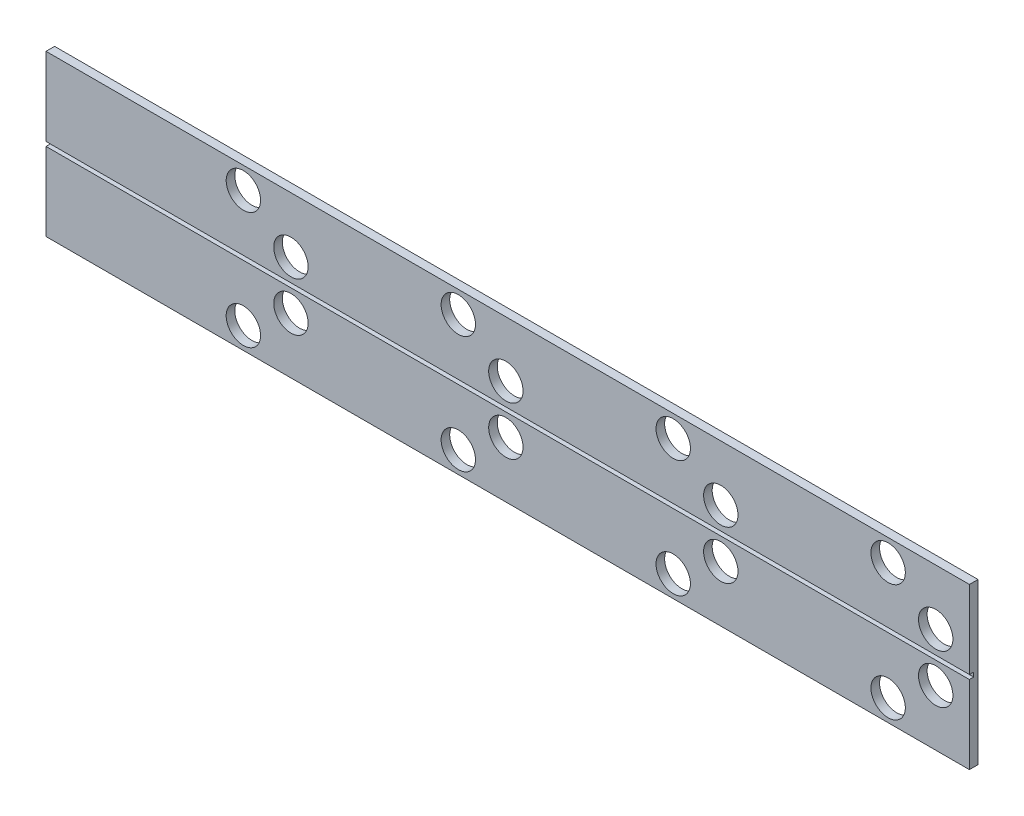
ISO-10303-21;
HEADER;
FILE_DESCRIPTION(('STEP AP214'),'2;1');
FILE_NAME('part.step','',(''),(''),'','','');
FILE_SCHEMA(('AUTOMOTIVE_DESIGN { 1 0 10303 214 1 1 1 1 }'));
ENDSEC;
DATA;
#1=APPLICATION_CONTEXT('core data for automotive mechanical design processes');
#2=APPLICATION_PROTOCOL_DEFINITION('international standard','automotive_design',2000,#1);
#3=PRODUCT_CONTEXT('',#1,'mechanical');
#4=PRODUCT('Part','Part','',(#3));
#5=PRODUCT_RELATED_PRODUCT_CATEGORY('part','',(#4));
#6=PRODUCT_DEFINITION_FORMATION('','',#4);
#7=PRODUCT_DEFINITION_CONTEXT('part definition',#1,'design');
#8=PRODUCT_DEFINITION('design','',#6,#7);
#9=PRODUCT_DEFINITION_SHAPE('','',#8);
#10=(LENGTH_UNIT() NAMED_UNIT(*) SI_UNIT(.MILLI.,.METRE.));
#11=(NAMED_UNIT(*) PLANE_ANGLE_UNIT() SI_UNIT($,.RADIAN.));
#12=(NAMED_UNIT(*) SI_UNIT($,.STERADIAN.) SOLID_ANGLE_UNIT());
#13=UNCERTAINTY_MEASURE_WITH_UNIT(LENGTH_MEASURE(1.E-05),#10,'distance_accuracy_value','');
#14=(GEOMETRIC_REPRESENTATION_CONTEXT(3) GLOBAL_UNCERTAINTY_ASSIGNED_CONTEXT((#13)) GLOBAL_UNIT_ASSIGNED_CONTEXT((#10,
#11,#12)) REPRESENTATION_CONTEXT('',''));
#15=CARTESIAN_POINT('',(0.,0.,0.));
#16=DIRECTION('',(0.,0.,1.));
#17=DIRECTION('',(1.,0.,0.));
#18=AXIS2_PLACEMENT_3D('',#15,#16,#17);
#19=CARTESIAN_POINT('',(0.,0.,0.2));
#20=DIRECTION('',(0.,0.,1.));
#21=DIRECTION('',(1.,0.,0.));
#22=AXIS2_PLACEMENT_3D('',#19,#20,#21);
#23=PLANE('',#22);
#24=CARTESIAN_POINT('',(-6.14935824448216,1.35966981169838,0.2));
#25=DIRECTION('',(0.,0.,1.));
#26=DIRECTION('',(1.,0.,0.));
#27=AXIS2_PLACEMENT_3D('',#24,#25,#26);
#28=CIRCLE('',#27,0.400000000000001);
#29=CARTESIAN_POINT('',(-5.74935824448216,1.35966981169838,0.2));
#30=VERTEX_POINT('',#29);
#31=EDGE_CURVE('E484',#30,#30,#28,.T.);
#32=ORIENTED_EDGE('',*,*,#31,.F.);
#33=EDGE_LOOP('',(#32));
#34=FACE_BOUND('',#33,.T.);
#35=CARTESIAN_POINT('',(-5.04281811205357,0.571259967343007,0.2));
#36=DIRECTION('',(0.,0.,1.));
#37=DIRECTION('',(1.,0.,0.));
#38=AXIS2_PLACEMENT_3D('',#35,#36,#37);
#39=CIRCLE('',#38,0.4);
#40=CARTESIAN_POINT('',(-4.64281811205357,0.571259967343007,0.2));
#41=VERTEX_POINT('',#40);
#42=EDGE_CURVE('E486',#41,#41,#39,.T.);
#43=ORIENTED_EDGE('',*,*,#42,.F.);
#44=EDGE_LOOP('',(#43));
#45=FACE_BOUND('',#44,.T.);
#46=CARTESIAN_POINT('',(-1.14935824448216,1.35966981169838,0.2));
#47=DIRECTION('',(0.,0.,1.));
#48=DIRECTION('',(1.,0.,0.));
#49=AXIS2_PLACEMENT_3D('',#46,#47,#48);
#50=CIRCLE('',#49,0.400000000000001);
#51=CARTESIAN_POINT('',(-0.749358244482159,1.35966981169838,0.2));
#52=VERTEX_POINT('',#51);
#53=EDGE_CURVE('E498',#52,#52,#50,.T.);
#54=ORIENTED_EDGE('',*,*,#53,.F.);
#55=EDGE_LOOP('',(#54));
#56=FACE_BOUND('',#55,.T.);
#57=CARTESIAN_POINT('',(-0.0428181120535696,0.571259967343007,0.2));
#58=DIRECTION('',(0.,0.,1.));
#59=DIRECTION('',(1.,0.,0.));
#60=AXIS2_PLACEMENT_3D('',#57,#58,#59);
#61=CIRCLE('',#60,0.4);
#62=CARTESIAN_POINT('',(0.35718188794643,0.571259967343007,0.2));
#63=VERTEX_POINT('',#62);
#64=EDGE_CURVE('E502',#63,#63,#61,.T.);
#65=ORIENTED_EDGE('',*,*,#64,.F.);
#66=EDGE_LOOP('',(#65));
#67=FACE_BOUND('',#66,.T.);
#68=CARTESIAN_POINT('',(3.85064175551784,1.35966981169838,0.2));
#69=DIRECTION('',(0.,0.,1.));
#70=DIRECTION('',(1.,0.,0.));
#71=AXIS2_PLACEMENT_3D('',#68,#69,#70);
#72=CIRCLE('',#71,0.400000000000001);
#73=CARTESIAN_POINT('',(4.25064175551784,1.35966981169838,0.2));
#74=VERTEX_POINT('',#73);
#75=EDGE_CURVE('E514',#74,#74,#72,.T.);
#76=ORIENTED_EDGE('',*,*,#75,.F.);
#77=EDGE_LOOP('',(#76));
#78=FACE_BOUND('',#77,.T.);
#79=CARTESIAN_POINT('',(4.95718188794643,0.571259967343007,0.2));
#80=DIRECTION('',(0.,0.,1.));
#81=DIRECTION('',(1.,0.,0.));
#82=AXIS2_PLACEMENT_3D('',#79,#80,#81);
#83=CIRCLE('',#82,0.4);
#84=CARTESIAN_POINT('',(5.35718188794643,0.571259967343007,0.2));
#85=VERTEX_POINT('',#84);
#86=EDGE_CURVE('E518',#85,#85,#83,.T.);
#87=ORIENTED_EDGE('',*,*,#86,.F.);
#88=EDGE_LOOP('',(#87));
#89=FACE_BOUND('',#88,.T.);
#90=CARTESIAN_POINT('',(8.85064175551784,1.35966981169838,0.2));
#91=DIRECTION('',(0.,0.,1.));
#92=DIRECTION('',(1.,0.,0.));
#93=AXIS2_PLACEMENT_3D('',#90,#91,#92);
#94=CIRCLE('',#93,0.400000000000001);
#95=CARTESIAN_POINT('',(9.25064175551784,1.35966981169838,0.2));
#96=VERTEX_POINT('',#95);
#97=EDGE_CURVE('E530',#96,#96,#94,.T.);
#98=ORIENTED_EDGE('',*,*,#97,.F.);
#99=EDGE_LOOP('',(#98));
#100=FACE_BOUND('',#99,.T.);
#101=CARTESIAN_POINT('',(9.95718188794643,0.571259967343007,0.2));
#102=DIRECTION('',(0.,0.,1.));
#103=DIRECTION('',(1.,0.,0.));
#104=AXIS2_PLACEMENT_3D('',#101,#102,#103);
#105=CIRCLE('',#104,0.4);
#106=CARTESIAN_POINT('',(10.3571818879464,0.571259967343007,0.2));
#107=VERTEX_POINT('',#106);
#108=EDGE_CURVE('E534',#107,#107,#105,.T.);
#109=ORIENTED_EDGE('',*,*,#108,.F.);
#110=EDGE_LOOP('',(#109));
#111=FACE_BOUND('',#110,.T.);
#112=DIRECTION('',(-1.,0.,0.));
#113=VECTOR('',#112,1.);
#114=CARTESIAN_POINT('',(10.7410625976883,0.05,0.2));
#115=LINE('',#114,#113);
#116=CARTESIAN_POINT('',(10.7410625976883,0.05,0.2));
#117=VERTEX_POINT('',#116);
#118=CARTESIAN_POINT('',(-10.7410625976883,0.05,0.2));
#119=VERTEX_POINT('',#118);
#120=EDGE_CURVE('E123',#117,#119,#115,.T.);
#121=ORIENTED_EDGE('',*,*,#120,.F.);
#122=DIRECTION('',(0.,1.,0.));
#123=VECTOR('',#122,1.);
#124=CARTESIAN_POINT('',(10.7410625976883,1.86597544762487,0.2));
#125=LINE('',#124,#123);
#126=CARTESIAN_POINT('',(10.7410625976883,1.86597544762487,0.2));
#127=VERTEX_POINT('',#126);
#128=EDGE_CURVE('E85',#117,#127,#125,.T.);
#129=ORIENTED_EDGE('',*,*,#128,.T.);
#130=DIRECTION('',(-1.,0.,0.));
#131=VECTOR('',#130,1.);
#132=CARTESIAN_POINT('',(-10.7410625976883,1.86597544762487,0.2));
#133=LINE('',#132,#131);
#134=CARTESIAN_POINT('',(-10.7410625976883,1.86597544762487,0.2));
#135=VERTEX_POINT('',#134);
#136=EDGE_CURVE('E137',#127,#135,#133,.T.);
#137=ORIENTED_EDGE('',*,*,#136,.T.);
#138=DIRECTION('',(0.,-1.,0.));
#139=VECTOR('',#138,1.);
#140=CARTESIAN_POINT('',(-10.7410625976883,1.86597544762487,0.2));
#141=LINE('',#140,#139);
#142=EDGE_CURVE('E139',#135,#119,#141,.T.);
#143=ORIENTED_EDGE('',*,*,#142,.T.);
#144=EDGE_LOOP('',(#121,#129,#137,#143));
#145=FACE_BOUND('',#144,.T.);
#146=ADVANCED_FACE('F32',(#34,#45,#56,#67,#78,#89,#100,#111,#145),#23,.T.);
#147=CARTESIAN_POINT('',(10.7410625976883,1.86597544762487,0.2));
#148=DIRECTION('',(-1.,0.,0.));
#149=DIRECTION('',(0.,0.,1.));
#150=AXIS2_PLACEMENT_3D('',#147,#148,#149);
#151=PLANE('',#150);
#152=ORIENTED_EDGE('',*,*,#128,.F.);
#153=DIRECTION('',(0.,0.,1.));
#154=VECTOR('',#153,1.);
#155=CARTESIAN_POINT('',(10.7410625976883,0.05,0.1));
#156=LINE('',#155,#154);
#157=CARTESIAN_POINT('',(10.7410625976883,0.05,0.1));
#158=VERTEX_POINT('',#157);
#159=EDGE_CURVE('E130',#158,#117,#156,.T.);
#160=ORIENTED_EDGE('',*,*,#159,.F.);
#161=DIRECTION('',(0.,1.,0.));
#162=VECTOR('',#161,1.);
#163=CARTESIAN_POINT('',(10.7410625976883,-0.05,0.1));
#164=LINE('',#163,#162);
#165=CARTESIAN_POINT('',(10.7410625976883,-0.05,0.1));
#166=VERTEX_POINT('',#165);
#167=EDGE_CURVE('E113',#166,#158,#164,.T.);
#168=ORIENTED_EDGE('',*,*,#167,.F.);
#169=DIRECTION('',(0.,0.,1.));
#170=VECTOR('',#169,1.);
#171=CARTESIAN_POINT('',(10.7410625976883,-0.05,0.1));
#172=LINE('',#171,#170);
#173=CARTESIAN_POINT('',(10.7410625976883,-0.05,0.2));
#174=VERTEX_POINT('',#173);
#175=EDGE_CURVE('E110',#166,#174,#172,.T.);
#176=ORIENTED_EDGE('',*,*,#175,.T.);
#177=CARTESIAN_POINT('',(10.7410625976883,-1.86597544762487,0.2));
#178=VERTEX_POINT('',#177);
#179=EDGE_CURVE('E135',#178,#174,#125,.T.);
#180=ORIENTED_EDGE('',*,*,#179,.F.);
#181=DIRECTION('',(0.,0.,-1.));
#182=VECTOR('',#181,1.);
#183=CARTESIAN_POINT('',(10.7410625976883,-1.86597544762487,0.2));
#184=LINE('',#183,#182);
#185=CARTESIAN_POINT('',(10.7410625976883,-1.86597544762487,0.));
#186=VERTEX_POINT('',#185);
#187=EDGE_CURVE('E143',#178,#186,#184,.T.);
#188=ORIENTED_EDGE('',*,*,#187,.T.);
#189=DIRECTION('',(0.,1.,0.));
#190=VECTOR('',#189,1.);
#191=CARTESIAN_POINT('',(10.7410625976883,1.86597544762487,0.));
#192=LINE('',#191,#190);
#193=CARTESIAN_POINT('',(10.7410625976883,1.86597544762487,0.));
#194=VERTEX_POINT('',#193);
#195=EDGE_CURVE('E144',#186,#194,#192,.T.);
#196=ORIENTED_EDGE('',*,*,#195,.T.);
#197=DIRECTION('',(0.,0.,-1.));
#198=VECTOR('',#197,1.);
#199=CARTESIAN_POINT('',(10.7410625976883,1.86597544762487,0.2));
#200=LINE('',#199,#198);
#201=EDGE_CURVE('E11',#127,#194,#200,.T.);
#202=ORIENTED_EDGE('',*,*,#201,.F.);
#203=EDGE_LOOP('',(#152,#160,#168,#176,#180,#188,#196,#202));
#204=FACE_BOUND('',#203,.T.);
#205=ADVANCED_FACE('F34',(#204),#151,.F.);
#206=CARTESIAN_POINT('',(-10.7410625976883,1.86597544762487,0.2));
#207=DIRECTION('',(0.,-1.,0.));
#208=DIRECTION('',(0.,0.,-1.));
#209=AXIS2_PLACEMENT_3D('',#206,#207,#208);
#210=PLANE('',#209);
#211=DIRECTION('',(-1.,0.,0.));
#212=VECTOR('',#211,1.);
#213=CARTESIAN_POINT('',(-10.7410625976883,1.86597544762487,0.));
#214=LINE('',#213,#212);
#215=CARTESIAN_POINT('',(-10.7410625976883,1.86597544762487,0.));
#216=VERTEX_POINT('',#215);
#217=EDGE_CURVE('E147',#194,#216,#214,.T.);
#218=ORIENTED_EDGE('',*,*,#217,.T.);
#219=DIRECTION('',(0.,0.,-1.));
#220=VECTOR('',#219,1.);
#221=CARTESIAN_POINT('',(-10.7410625976883,1.86597544762487,0.2));
#222=LINE('',#221,#220);
#223=EDGE_CURVE('E40',#135,#216,#222,.T.);
#224=ORIENTED_EDGE('',*,*,#223,.F.);
#225=ORIENTED_EDGE('',*,*,#136,.F.);
#226=ORIENTED_EDGE('',*,*,#201,.T.);
#227=EDGE_LOOP('',(#218,#224,#225,#226));
#228=FACE_BOUND('',#227,.T.);
#229=ADVANCED_FACE('F176',(#228),#210,.F.);
#230=CARTESIAN_POINT('',(-10.7410625976883,1.86597544762487,0.2));
#231=DIRECTION('',(1.,0.,0.));
#232=DIRECTION('',(0.,0.,-1.));
#233=AXIS2_PLACEMENT_3D('',#230,#231,#232);
#234=PLANE('',#233);
#235=DIRECTION('',(0.,-1.,0.));
#236=VECTOR('',#235,1.);
#237=CARTESIAN_POINT('',(-10.7410625976883,-0.05,0.1));
#238=LINE('',#237,#236);
#239=CARTESIAN_POINT('',(-10.7410625976883,0.05,0.1));
#240=VERTEX_POINT('',#239);
#241=CARTESIAN_POINT('',(-10.7410625976883,-0.05,0.1));
#242=VERTEX_POINT('',#241);
#243=EDGE_CURVE('E114',#240,#242,#238,.T.);
#244=ORIENTED_EDGE('',*,*,#243,.F.);
#245=DIRECTION('',(0.,0.,1.));
#246=VECTOR('',#245,1.);
#247=CARTESIAN_POINT('',(-10.7410625976883,0.05,0.1));
#248=LINE('',#247,#246);
#249=EDGE_CURVE('E148',#240,#119,#248,.T.);
#250=ORIENTED_EDGE('',*,*,#249,.T.);
#251=ORIENTED_EDGE('',*,*,#142,.F.);
#252=ORIENTED_EDGE('',*,*,#223,.T.);
#253=DIRECTION('',(0.,-1.,0.));
#254=VECTOR('',#253,1.);
#255=CARTESIAN_POINT('',(-10.7410625976883,1.86597544762487,0.));
#256=LINE('',#255,#254);
#257=CARTESIAN_POINT('',(-10.7410625976883,-1.86597544762487,0.));
#258=VERTEX_POINT('',#257);
#259=EDGE_CURVE('E150',#216,#258,#256,.T.);
#260=ORIENTED_EDGE('',*,*,#259,.T.);
#261=DIRECTION('',(0.,0.,-1.));
#262=VECTOR('',#261,1.);
#263=CARTESIAN_POINT('',(-10.7410625976883,-1.86597544762487,0.2));
#264=LINE('',#263,#262);
#265=CARTESIAN_POINT('',(-10.7410625976883,-1.86597544762487,0.2));
#266=VERTEX_POINT('',#265);
#267=EDGE_CURVE('E154',#266,#258,#264,.T.);
#268=ORIENTED_EDGE('',*,*,#267,.F.);
#269=CARTESIAN_POINT('',(-10.7410625976883,-0.0499999999999999,0.2));
#270=VERTEX_POINT('',#269);
#271=EDGE_CURVE('E128',#270,#266,#141,.T.);
#272=ORIENTED_EDGE('',*,*,#271,.F.);
#273=DIRECTION('',(0.,0.,1.));
#274=VECTOR('',#273,1.);
#275=CARTESIAN_POINT('',(-10.7410625976883,-0.05,0.1));
#276=LINE('',#275,#274);
#277=EDGE_CURVE('E47',#242,#270,#276,.T.);
#278=ORIENTED_EDGE('',*,*,#277,.F.);
#279=EDGE_LOOP('',(#244,#250,#251,#252,#260,#268,#272,#278));
#280=FACE_BOUND('',#279,.T.);
#281=ADVANCED_FACE('F126',(#280),#234,.F.);
#282=CARTESIAN_POINT('',(-10.7410625976883,-1.86597544762487,0.2));
#283=DIRECTION('',(0.,1.,0.));
#284=DIRECTION('',(0.,0.,1.));
#285=AXIS2_PLACEMENT_3D('',#282,#283,#284);
#286=PLANE('',#285);
#287=DIRECTION('',(1.,0.,0.));
#288=VECTOR('',#287,1.);
#289=CARTESIAN_POINT('',(-10.7410625976883,-1.86597544762487,0.));
#290=LINE('',#289,#288);
#291=EDGE_CURVE('E77',#258,#186,#290,.T.);
#292=ORIENTED_EDGE('',*,*,#291,.T.);
#293=ORIENTED_EDGE('',*,*,#187,.F.);
#294=DIRECTION('',(1.,0.,0.));
#295=VECTOR('',#294,1.);
#296=CARTESIAN_POINT('',(-10.7410625976883,-1.86597544762487,0.2));
#297=LINE('',#296,#295);
#298=EDGE_CURVE('E56',#266,#178,#297,.T.);
#299=ORIENTED_EDGE('',*,*,#298,.F.);
#300=ORIENTED_EDGE('',*,*,#267,.T.);
#301=EDGE_LOOP('',(#292,#293,#299,#300));
#302=FACE_BOUND('',#301,.T.);
#303=ADVANCED_FACE('F166',(#302),#286,.F.);
#304=CARTESIAN_POINT('',(-6.14935824448216,-1.36518526440703,0.2));
#305=DIRECTION('',(0.,0.,1.));
#306=DIRECTION('',(1.,0.,0.));
#307=AXIS2_PLACEMENT_3D('',#304,#305,#306);
#308=CIRCLE('',#307,0.400000000000001);
#309=CARTESIAN_POINT('',(-5.74935824448216,-1.36518526440703,0.2));
#310=VERTEX_POINT('',#309);
#311=EDGE_CURVE('E490',#310,#310,#308,.T.);
#312=ORIENTED_EDGE('',*,*,#311,.F.);
#313=EDGE_LOOP('',(#312));
#314=FACE_BOUND('',#313,.T.);
#315=CARTESIAN_POINT('',(-5.04281811205357,-0.562943668396298,0.2));
#316=DIRECTION('',(0.,0.,1.));
#317=DIRECTION('',(1.,0.,0.));
#318=AXIS2_PLACEMENT_3D('',#315,#316,#317);
#319=CIRCLE('',#318,0.4);
#320=CARTESIAN_POINT('',(-4.64281811205357,-0.562943668396298,0.2));
#321=VERTEX_POINT('',#320);
#322=EDGE_CURVE('E494',#321,#321,#319,.T.);
#323=ORIENTED_EDGE('',*,*,#322,.F.);
#324=EDGE_LOOP('',(#323));
#325=FACE_BOUND('',#324,.T.);
#326=CARTESIAN_POINT('',(-1.14935824448216,-1.36518526440703,0.2));
#327=DIRECTION('',(0.,0.,1.));
#328=DIRECTION('',(1.,0.,0.));
#329=AXIS2_PLACEMENT_3D('',#326,#327,#328);
#330=CIRCLE('',#329,0.400000000000001);
#331=CARTESIAN_POINT('',(-0.749358244482159,-1.36518526440703,0.2));
#332=VERTEX_POINT('',#331);
#333=EDGE_CURVE('E506',#332,#332,#330,.T.);
#334=ORIENTED_EDGE('',*,*,#333,.F.);
#335=EDGE_LOOP('',(#334));
#336=FACE_BOUND('',#335,.T.);
#337=CARTESIAN_POINT('',(-0.0428181120535696,-0.562943668396298,0.2));
#338=DIRECTION('',(0.,0.,1.));
#339=DIRECTION('',(1.,0.,0.));
#340=AXIS2_PLACEMENT_3D('',#337,#338,#339);
#341=CIRCLE('',#340,0.4);
#342=CARTESIAN_POINT('',(0.35718188794643,-0.562943668396298,0.2));
#343=VERTEX_POINT('',#342);
#344=EDGE_CURVE('E510',#343,#343,#341,.T.);
#345=ORIENTED_EDGE('',*,*,#344,.F.);
#346=EDGE_LOOP('',(#345));
#347=FACE_BOUND('',#346,.T.);
#348=CARTESIAN_POINT('',(3.85064175551784,-1.36518526440703,0.2));
#349=DIRECTION('',(0.,0.,1.));
#350=DIRECTION('',(1.,0.,0.));
#351=AXIS2_PLACEMENT_3D('',#348,#349,#350);
#352=CIRCLE('',#351,0.400000000000001);
#353=CARTESIAN_POINT('',(4.25064175551784,-1.36518526440703,0.2));
#354=VERTEX_POINT('',#353);
#355=EDGE_CURVE('E522',#354,#354,#352,.T.);
#356=ORIENTED_EDGE('',*,*,#355,.F.);
#357=EDGE_LOOP('',(#356));
#358=FACE_BOUND('',#357,.T.);
#359=CARTESIAN_POINT('',(4.95718188794643,-0.562943668396298,0.2));
#360=DIRECTION('',(0.,0.,1.));
#361=DIRECTION('',(1.,0.,0.));
#362=AXIS2_PLACEMENT_3D('',#359,#360,#361);
#363=CIRCLE('',#362,0.4);
#364=CARTESIAN_POINT('',(5.35718188794643,-0.562943668396298,0.2));
#365=VERTEX_POINT('',#364);
#366=EDGE_CURVE('E526',#365,#365,#363,.T.);
#367=ORIENTED_EDGE('',*,*,#366,.F.);
#368=EDGE_LOOP('',(#367));
#369=FACE_BOUND('',#368,.T.);
#370=CARTESIAN_POINT('',(8.85064175551784,-1.36518526440703,0.2));
#371=DIRECTION('',(0.,0.,1.));
#372=DIRECTION('',(1.,0.,0.));
#373=AXIS2_PLACEMENT_3D('',#370,#371,#372);
#374=CIRCLE('',#373,0.400000000000001);
#375=CARTESIAN_POINT('',(9.25064175551784,-1.36518526440703,0.2));
#376=VERTEX_POINT('',#375);
#377=EDGE_CURVE('E266',#376,#376,#374,.T.);
#378=ORIENTED_EDGE('',*,*,#377,.F.);
#379=EDGE_LOOP('',(#378));
#380=FACE_BOUND('',#379,.T.);
#381=CARTESIAN_POINT('',(9.95718188794643,-0.562943668396298,0.2));
#382=DIRECTION('',(0.,0.,1.));
#383=DIRECTION('',(1.,0.,0.));
#384=AXIS2_PLACEMENT_3D('',#381,#382,#383);
#385=CIRCLE('',#384,0.4);
#386=CARTESIAN_POINT('',(10.3571818879464,-0.562943668396298,0.2));
#387=VERTEX_POINT('',#386);
#388=EDGE_CURVE('E260',#387,#387,#385,.T.);
#389=ORIENTED_EDGE('',*,*,#388,.F.);
#390=EDGE_LOOP('',(#389));
#391=FACE_BOUND('',#390,.T.);
#392=DIRECTION('',(1.,0.,0.));
#393=VECTOR('',#392,1.);
#394=CARTESIAN_POINT('',(10.7410625976883,-0.05,0.2));
#395=LINE('',#394,#393);
#396=EDGE_CURVE('E259',#270,#174,#395,.T.);
#397=ORIENTED_EDGE('',*,*,#396,.F.);
#398=ORIENTED_EDGE('',*,*,#271,.T.);
#399=ORIENTED_EDGE('',*,*,#298,.T.);
#400=ORIENTED_EDGE('',*,*,#179,.T.);
#401=EDGE_LOOP('',(#397,#398,#399,#400));
#402=FACE_BOUND('',#401,.T.);
#403=ADVANCED_FACE('F168',(#314,#325,#336,#347,#358,#369,#380,#391,#402),#23,.T.);
#404=CARTESIAN_POINT('',(0.,0.,0.));
#405=DIRECTION('',(0.,0.,1.));
#406=DIRECTION('',(1.,0.,0.));
#407=AXIS2_PLACEMENT_3D('',#404,#405,#406);
#408=PLANE('',#407);
#409=CARTESIAN_POINT('',(-6.14935824448216,1.35966981169838,0.));
#410=DIRECTION('',(0.,0.,1.));
#411=DIRECTION('',(1.,0.,0.));
#412=AXIS2_PLACEMENT_3D('',#409,#410,#411);
#413=CIRCLE('',#412,0.400000000000001);
#414=CARTESIAN_POINT('',(-5.74935824448216,1.35966981169838,0.));
#415=VERTEX_POINT('',#414);
#416=EDGE_CURVE('E198',#415,#415,#413,.T.);
#417=ORIENTED_EDGE('',*,*,#416,.T.);
#418=EDGE_LOOP('',(#417));
#419=FACE_BOUND('',#418,.T.);
#420=CARTESIAN_POINT('',(-5.04281811205357,0.571259967343007,0.));
#421=DIRECTION('',(0.,0.,1.));
#422=DIRECTION('',(1.,0.,0.));
#423=AXIS2_PLACEMENT_3D('',#420,#421,#422);
#424=CIRCLE('',#423,0.4);
#425=CARTESIAN_POINT('',(-4.64281811205357,0.571259967343007,0.));
#426=VERTEX_POINT('',#425);
#427=EDGE_CURVE('E202',#426,#426,#424,.T.);
#428=ORIENTED_EDGE('',*,*,#427,.T.);
#429=EDGE_LOOP('',(#428));
#430=FACE_BOUND('',#429,.T.);
#431=CARTESIAN_POINT('',(-6.14935824448216,-1.36518526440703,0.));
#432=DIRECTION('',(0.,0.,1.));
#433=DIRECTION('',(1.,0.,0.));
#434=AXIS2_PLACEMENT_3D('',#431,#432,#433);
#435=CIRCLE('',#434,0.400000000000001);
#436=CARTESIAN_POINT('',(-5.74935824448216,-1.36518526440703,0.));
#437=VERTEX_POINT('',#436);
#438=EDGE_CURVE('E206',#437,#437,#435,.T.);
#439=ORIENTED_EDGE('',*,*,#438,.T.);
#440=EDGE_LOOP('',(#439));
#441=FACE_BOUND('',#440,.T.);
#442=CARTESIAN_POINT('',(-5.04281811205357,-0.562943668396298,0.));
#443=DIRECTION('',(0.,0.,1.));
#444=DIRECTION('',(1.,0.,0.));
#445=AXIS2_PLACEMENT_3D('',#442,#443,#444);
#446=CIRCLE('',#445,0.4);
#447=CARTESIAN_POINT('',(-4.64281811205357,-0.562943668396298,0.));
#448=VERTEX_POINT('',#447);
#449=EDGE_CURVE('E210',#448,#448,#446,.T.);
#450=ORIENTED_EDGE('',*,*,#449,.T.);
#451=EDGE_LOOP('',(#450));
#452=FACE_BOUND('',#451,.T.);
#453=CARTESIAN_POINT('',(-1.14935824448216,1.35966981169838,0.));
#454=DIRECTION('',(0.,0.,1.));
#455=DIRECTION('',(1.,0.,0.));
#456=AXIS2_PLACEMENT_3D('',#453,#454,#455);
#457=CIRCLE('',#456,0.400000000000001);
#458=CARTESIAN_POINT('',(-0.749358244482159,1.35966981169838,0.));
#459=VERTEX_POINT('',#458);
#460=EDGE_CURVE('E214',#459,#459,#457,.T.);
#461=ORIENTED_EDGE('',*,*,#460,.T.);
#462=EDGE_LOOP('',(#461));
#463=FACE_BOUND('',#462,.T.);
#464=CARTESIAN_POINT('',(-0.0428181120535696,0.571259967343007,0.));
#465=DIRECTION('',(0.,0.,1.));
#466=DIRECTION('',(1.,0.,0.));
#467=AXIS2_PLACEMENT_3D('',#464,#465,#466);
#468=CIRCLE('',#467,0.4);
#469=CARTESIAN_POINT('',(0.35718188794643,0.571259967343007,0.));
#470=VERTEX_POINT('',#469);
#471=EDGE_CURVE('E218',#470,#470,#468,.T.);
#472=ORIENTED_EDGE('',*,*,#471,.T.);
#473=EDGE_LOOP('',(#472));
#474=FACE_BOUND('',#473,.T.);
#475=CARTESIAN_POINT('',(-1.14935824448216,-1.36518526440703,0.));
#476=DIRECTION('',(0.,0.,1.));
#477=DIRECTION('',(1.,0.,0.));
#478=AXIS2_PLACEMENT_3D('',#475,#476,#477);
#479=CIRCLE('',#478,0.400000000000001);
#480=CARTESIAN_POINT('',(-0.749358244482159,-1.36518526440703,0.));
#481=VERTEX_POINT('',#480);
#482=EDGE_CURVE('E222',#481,#481,#479,.T.);
#483=ORIENTED_EDGE('',*,*,#482,.T.);
#484=EDGE_LOOP('',(#483));
#485=FACE_BOUND('',#484,.T.);
#486=CARTESIAN_POINT('',(-0.0428181120535696,-0.562943668396298,0.));
#487=DIRECTION('',(0.,0.,1.));
#488=DIRECTION('',(1.,0.,0.));
#489=AXIS2_PLACEMENT_3D('',#486,#487,#488);
#490=CIRCLE('',#489,0.4);
#491=CARTESIAN_POINT('',(0.35718188794643,-0.562943668396298,0.));
#492=VERTEX_POINT('',#491);
#493=EDGE_CURVE('E226',#492,#492,#490,.T.);
#494=ORIENTED_EDGE('',*,*,#493,.T.);
#495=EDGE_LOOP('',(#494));
#496=FACE_BOUND('',#495,.T.);
#497=CARTESIAN_POINT('',(3.85064175551784,1.35966981169838,0.));
#498=DIRECTION('',(0.,0.,1.));
#499=DIRECTION('',(1.,0.,0.));
#500=AXIS2_PLACEMENT_3D('',#497,#498,#499);
#501=CIRCLE('',#500,0.400000000000001);
#502=CARTESIAN_POINT('',(4.25064175551784,1.35966981169838,0.));
#503=VERTEX_POINT('',#502);
#504=EDGE_CURVE('E230',#503,#503,#501,.T.);
#505=ORIENTED_EDGE('',*,*,#504,.T.);
#506=EDGE_LOOP('',(#505));
#507=FACE_BOUND('',#506,.T.);
#508=CARTESIAN_POINT('',(4.95718188794643,0.571259967343007,0.));
#509=DIRECTION('',(0.,0.,1.));
#510=DIRECTION('',(1.,0.,0.));
#511=AXIS2_PLACEMENT_3D('',#508,#509,#510);
#512=CIRCLE('',#511,0.4);
#513=CARTESIAN_POINT('',(5.35718188794643,0.571259967343007,0.));
#514=VERTEX_POINT('',#513);
#515=EDGE_CURVE('E234',#514,#514,#512,.T.);
#516=ORIENTED_EDGE('',*,*,#515,.T.);
#517=EDGE_LOOP('',(#516));
#518=FACE_BOUND('',#517,.T.);
#519=CARTESIAN_POINT('',(3.85064175551784,-1.36518526440703,0.));
#520=DIRECTION('',(0.,0.,1.));
#521=DIRECTION('',(1.,0.,0.));
#522=AXIS2_PLACEMENT_3D('',#519,#520,#521);
#523=CIRCLE('',#522,0.400000000000001);
#524=CARTESIAN_POINT('',(4.25064175551784,-1.36518526440703,0.));
#525=VERTEX_POINT('',#524);
#526=EDGE_CURVE('E238',#525,#525,#523,.T.);
#527=ORIENTED_EDGE('',*,*,#526,.T.);
#528=EDGE_LOOP('',(#527));
#529=FACE_BOUND('',#528,.T.);
#530=CARTESIAN_POINT('',(4.95718188794643,-0.562943668396298,0.));
#531=DIRECTION('',(0.,0.,1.));
#532=DIRECTION('',(1.,0.,0.));
#533=AXIS2_PLACEMENT_3D('',#530,#531,#532);
#534=CIRCLE('',#533,0.4);
#535=CARTESIAN_POINT('',(5.35718188794643,-0.562943668396298,0.));
#536=VERTEX_POINT('',#535);
#537=EDGE_CURVE('E242',#536,#536,#534,.T.);
#538=ORIENTED_EDGE('',*,*,#537,.T.);
#539=EDGE_LOOP('',(#538));
#540=FACE_BOUND('',#539,.T.);
#541=CARTESIAN_POINT('',(8.85064175551784,1.35966981169838,0.));
#542=DIRECTION('',(0.,0.,1.));
#543=DIRECTION('',(1.,0.,0.));
#544=AXIS2_PLACEMENT_3D('',#541,#542,#543);
#545=CIRCLE('',#544,0.400000000000001);
#546=CARTESIAN_POINT('',(9.25064175551784,1.35966981169838,0.));
#547=VERTEX_POINT('',#546);
#548=EDGE_CURVE('E246',#547,#547,#545,.T.);
#549=ORIENTED_EDGE('',*,*,#548,.T.);
#550=EDGE_LOOP('',(#549));
#551=FACE_BOUND('',#550,.T.);
#552=CARTESIAN_POINT('',(9.95718188794643,0.571259967343007,0.));
#553=DIRECTION('',(0.,0.,1.));
#554=DIRECTION('',(1.,0.,0.));
#555=AXIS2_PLACEMENT_3D('',#552,#553,#554);
#556=CIRCLE('',#555,0.4);
#557=CARTESIAN_POINT('',(10.3571818879464,0.571259967343007,0.));
#558=VERTEX_POINT('',#557);
#559=EDGE_CURVE('E250',#558,#558,#556,.T.);
#560=ORIENTED_EDGE('',*,*,#559,.T.);
#561=EDGE_LOOP('',(#560));
#562=FACE_BOUND('',#561,.T.);
#563=CARTESIAN_POINT('',(8.85064175551784,-1.36518526440703,0.));
#564=DIRECTION('',(0.,0.,1.));
#565=DIRECTION('',(1.,0.,0.));
#566=AXIS2_PLACEMENT_3D('',#563,#564,#565);
#567=CIRCLE('',#566,0.400000000000001);
#568=CARTESIAN_POINT('',(9.25064175551784,-1.36518526440703,0.));
#569=VERTEX_POINT('',#568);
#570=EDGE_CURVE('E254',#569,#569,#567,.T.);
#571=ORIENTED_EDGE('',*,*,#570,.T.);
#572=EDGE_LOOP('',(#571));
#573=FACE_BOUND('',#572,.T.);
#574=CARTESIAN_POINT('',(9.95718188794643,-0.562943668396298,0.));
#575=DIRECTION('',(0.,0.,1.));
#576=DIRECTION('',(1.,0.,0.));
#577=AXIS2_PLACEMENT_3D('',#574,#575,#576);
#578=CIRCLE('',#577,0.4);
#579=CARTESIAN_POINT('',(10.3571818879464,-0.562943668396298,0.));
#580=VERTEX_POINT('',#579);
#581=EDGE_CURVE('E257',#580,#580,#578,.T.);
#582=ORIENTED_EDGE('',*,*,#581,.T.);
#583=EDGE_LOOP('',(#582));
#584=FACE_BOUND('',#583,.T.);
#585=ORIENTED_EDGE('',*,*,#195,.F.);
#586=ORIENTED_EDGE('',*,*,#291,.F.);
#587=ORIENTED_EDGE('',*,*,#259,.F.);
#588=ORIENTED_EDGE('',*,*,#217,.F.);
#589=EDGE_LOOP('',(#585,#586,#587,#588));
#590=FACE_BOUND('',#589,.T.);
#591=ADVANCED_FACE('F162',(#419,#430,#441,#452,#463,#474,#485,#496,#507,#518,#529,#540,#551,
#562,#573,#584,#590),#408,.F.);
#592=CARTESIAN_POINT('',(10.7410625976883,0.05,0.1));
#593=DIRECTION('',(0.,1.,0.));
#594=DIRECTION('',(0.,0.,1.));
#595=AXIS2_PLACEMENT_3D('',#592,#593,#594);
#596=PLANE('',#595);
#597=ORIENTED_EDGE('',*,*,#120,.T.);
#598=ORIENTED_EDGE('',*,*,#249,.F.);
#599=DIRECTION('',(-1.,0.,0.));
#600=VECTOR('',#599,1.);
#601=CARTESIAN_POINT('',(10.7410625976883,0.05,0.1));
#602=LINE('',#601,#600);
#603=EDGE_CURVE('E120',#158,#240,#602,.T.);
#604=ORIENTED_EDGE('',*,*,#603,.F.);
#605=ORIENTED_EDGE('',*,*,#159,.T.);
#606=EDGE_LOOP('',(#597,#598,#604,#605));
#607=FACE_BOUND('',#606,.T.);
#608=ADVANCED_FACE('F189',(#607),#596,.F.);
#609=CARTESIAN_POINT('',(10.7410625976883,-0.05,0.1));
#610=DIRECTION('',(0.,-1.,0.));
#611=DIRECTION('',(0.,0.,-1.));
#612=AXIS2_PLACEMENT_3D('',#609,#610,#611);
#613=PLANE('',#612);
#614=ORIENTED_EDGE('',*,*,#396,.T.);
#615=ORIENTED_EDGE('',*,*,#175,.F.);
#616=DIRECTION('',(1.,0.,0.));
#617=VECTOR('',#616,1.);
#618=CARTESIAN_POINT('',(10.7410625976883,-0.05,0.1));
#619=LINE('',#618,#617);
#620=EDGE_CURVE('E106',#242,#166,#619,.T.);
#621=ORIENTED_EDGE('',*,*,#620,.F.);
#622=ORIENTED_EDGE('',*,*,#277,.T.);
#623=EDGE_LOOP('',(#614,#615,#621,#622));
#624=FACE_BOUND('',#623,.T.);
#625=ADVANCED_FACE('F108',(#624),#613,.F.);
#626=CARTESIAN_POINT('',(0.,0.,0.1));
#627=DIRECTION('',(0.,0.,1.));
#628=DIRECTION('',(1.,0.,0.));
#629=AXIS2_PLACEMENT_3D('',#626,#627,#628);
#630=PLANE('',#629);
#631=ORIENTED_EDGE('',*,*,#243,.T.);
#632=ORIENTED_EDGE('',*,*,#620,.T.);
#633=ORIENTED_EDGE('',*,*,#167,.T.);
#634=ORIENTED_EDGE('',*,*,#603,.T.);
#635=EDGE_LOOP('',(#631,#632,#633,#634));
#636=FACE_BOUND('',#635,.T.);
#637=ADVANCED_FACE('F118',(#636),#630,.T.);
#638=CARTESIAN_POINT('',(9.95718188794643,-0.562943668396298,0.));
#639=DIRECTION('',(0.,0.,1.));
#640=DIRECTION('',(1.,0.,0.));
#641=AXIS2_PLACEMENT_3D('',#638,#639,#640);
#642=CYLINDRICAL_SURFACE('',#641,0.4);
#643=ORIENTED_EDGE('',*,*,#581,.F.);
#644=EDGE_LOOP('',(#643));
#645=FACE_BOUND('',#644,.T.);
#646=ORIENTED_EDGE('',*,*,#388,.T.);
#647=EDGE_LOOP('',(#646));
#648=FACE_BOUND('',#647,.T.);
#649=ADVANCED_FACE('F307',(#645,#648),#642,.F.);
#650=CARTESIAN_POINT('',(8.85064175551784,-1.36518526440703,0.));
#651=DIRECTION('',(0.,0.,1.));
#652=DIRECTION('',(1.,0.,0.));
#653=AXIS2_PLACEMENT_3D('',#650,#651,#652);
#654=CYLINDRICAL_SURFACE('',#653,0.400000000000001);
#655=ORIENTED_EDGE('',*,*,#570,.F.);
#656=EDGE_LOOP('',(#655));
#657=FACE_BOUND('',#656,.T.);
#658=ORIENTED_EDGE('',*,*,#377,.T.);
#659=EDGE_LOOP('',(#658));
#660=FACE_BOUND('',#659,.T.);
#661=ADVANCED_FACE('F316',(#657,#660),#654,.F.);
#662=CARTESIAN_POINT('',(9.95718188794643,0.571259967343007,0.));
#663=DIRECTION('',(0.,0.,1.));
#664=DIRECTION('',(1.,0.,0.));
#665=AXIS2_PLACEMENT_3D('',#662,#663,#664);
#666=CYLINDRICAL_SURFACE('',#665,0.4);
#667=ORIENTED_EDGE('',*,*,#559,.F.);
#668=EDGE_LOOP('',(#667));
#669=FACE_BOUND('',#668,.T.);
#670=ORIENTED_EDGE('',*,*,#108,.T.);
#671=EDGE_LOOP('',(#670));
#672=FACE_BOUND('',#671,.T.);
#673=ADVANCED_FACE('F325',(#669,#672),#666,.F.);
#674=CARTESIAN_POINT('',(8.85064175551784,1.35966981169838,0.));
#675=DIRECTION('',(0.,0.,1.));
#676=DIRECTION('',(1.,0.,0.));
#677=AXIS2_PLACEMENT_3D('',#674,#675,#676);
#678=CYLINDRICAL_SURFACE('',#677,0.400000000000001);
#679=ORIENTED_EDGE('',*,*,#548,.F.);
#680=EDGE_LOOP('',(#679));
#681=FACE_BOUND('',#680,.T.);
#682=ORIENTED_EDGE('',*,*,#97,.T.);
#683=EDGE_LOOP('',(#682));
#684=FACE_BOUND('',#683,.T.);
#685=ADVANCED_FACE('F335',(#681,#684),#678,.F.);
#686=CARTESIAN_POINT('',(4.95718188794643,-0.562943668396298,0.));
#687=DIRECTION('',(0.,0.,1.));
#688=DIRECTION('',(1.,0.,0.));
#689=AXIS2_PLACEMENT_3D('',#686,#687,#688);
#690=CYLINDRICAL_SURFACE('',#689,0.4);
#691=ORIENTED_EDGE('',*,*,#537,.F.);
#692=EDGE_LOOP('',(#691));
#693=FACE_BOUND('',#692,.T.);
#694=ORIENTED_EDGE('',*,*,#366,.T.);
#695=EDGE_LOOP('',(#694));
#696=FACE_BOUND('',#695,.T.);
#697=ADVANCED_FACE('F344',(#693,#696),#690,.F.);
#698=CARTESIAN_POINT('',(3.85064175551784,-1.36518526440703,0.));
#699=DIRECTION('',(0.,0.,1.));
#700=DIRECTION('',(1.,0.,0.));
#701=AXIS2_PLACEMENT_3D('',#698,#699,#700);
#702=CYLINDRICAL_SURFACE('',#701,0.400000000000001);
#703=ORIENTED_EDGE('',*,*,#526,.F.);
#704=EDGE_LOOP('',(#703));
#705=FACE_BOUND('',#704,.T.);
#706=ORIENTED_EDGE('',*,*,#355,.T.);
#707=EDGE_LOOP('',(#706));
#708=FACE_BOUND('',#707,.T.);
#709=ADVANCED_FACE('F368',(#705,#708),#702,.F.);
#710=CARTESIAN_POINT('',(4.95718188794643,0.571259967343007,0.));
#711=DIRECTION('',(0.,0.,1.));
#712=DIRECTION('',(1.,0.,0.));
#713=AXIS2_PLACEMENT_3D('',#710,#711,#712);
#714=CYLINDRICAL_SURFACE('',#713,0.4);
#715=ORIENTED_EDGE('',*,*,#515,.F.);
#716=EDGE_LOOP('',(#715));
#717=FACE_BOUND('',#716,.T.);
#718=ORIENTED_EDGE('',*,*,#86,.T.);
#719=EDGE_LOOP('',(#718));
#720=FACE_BOUND('',#719,.T.);
#721=ADVANCED_FACE('F378',(#717,#720),#714,.F.);
#722=CARTESIAN_POINT('',(3.85064175551784,1.35966981169838,0.));
#723=DIRECTION('',(0.,0.,1.));
#724=DIRECTION('',(1.,0.,0.));
#725=AXIS2_PLACEMENT_3D('',#722,#723,#724);
#726=CYLINDRICAL_SURFACE('',#725,0.400000000000001);
#727=ORIENTED_EDGE('',*,*,#504,.F.);
#728=EDGE_LOOP('',(#727));
#729=FACE_BOUND('',#728,.T.);
#730=ORIENTED_EDGE('',*,*,#75,.T.);
#731=EDGE_LOOP('',(#730));
#732=FACE_BOUND('',#731,.T.);
#733=ADVANCED_FACE('F388',(#729,#732),#726,.F.);
#734=CARTESIAN_POINT('',(-0.0428181120535696,-0.562943668396298,0.));
#735=DIRECTION('',(0.,0.,1.));
#736=DIRECTION('',(1.,0.,0.));
#737=AXIS2_PLACEMENT_3D('',#734,#735,#736);
#738=CYLINDRICAL_SURFACE('',#737,0.4);
#739=ORIENTED_EDGE('',*,*,#493,.F.);
#740=EDGE_LOOP('',(#739));
#741=FACE_BOUND('',#740,.T.);
#742=ORIENTED_EDGE('',*,*,#344,.T.);
#743=EDGE_LOOP('',(#742));
#744=FACE_BOUND('',#743,.T.);
#745=ADVANCED_FACE('F398',(#741,#744),#738,.F.);
#746=CARTESIAN_POINT('',(-1.14935824448216,-1.36518526440703,0.));
#747=DIRECTION('',(0.,0.,1.));
#748=DIRECTION('',(1.,0.,0.));
#749=AXIS2_PLACEMENT_3D('',#746,#747,#748);
#750=CYLINDRICAL_SURFACE('',#749,0.400000000000001);
#751=ORIENTED_EDGE('',*,*,#482,.F.);
#752=EDGE_LOOP('',(#751));
#753=FACE_BOUND('',#752,.T.);
#754=ORIENTED_EDGE('',*,*,#333,.T.);
#755=EDGE_LOOP('',(#754));
#756=FACE_BOUND('',#755,.T.);
#757=ADVANCED_FACE('F408',(#753,#756),#750,.F.);
#758=CARTESIAN_POINT('',(-0.0428181120535696,0.571259967343007,0.));
#759=DIRECTION('',(0.,0.,1.));
#760=DIRECTION('',(1.,0.,0.));
#761=AXIS2_PLACEMENT_3D('',#758,#759,#760);
#762=CYLINDRICAL_SURFACE('',#761,0.4);
#763=ORIENTED_EDGE('',*,*,#471,.F.);
#764=EDGE_LOOP('',(#763));
#765=FACE_BOUND('',#764,.T.);
#766=ORIENTED_EDGE('',*,*,#64,.T.);
#767=EDGE_LOOP('',(#766));
#768=FACE_BOUND('',#767,.T.);
#769=ADVANCED_FACE('F418',(#765,#768),#762,.F.);
#770=CARTESIAN_POINT('',(-1.14935824448216,1.35966981169838,0.));
#771=DIRECTION('',(0.,0.,1.));
#772=DIRECTION('',(1.,0.,0.));
#773=AXIS2_PLACEMENT_3D('',#770,#771,#772);
#774=CYLINDRICAL_SURFACE('',#773,0.400000000000001);
#775=ORIENTED_EDGE('',*,*,#460,.F.);
#776=EDGE_LOOP('',(#775));
#777=FACE_BOUND('',#776,.T.);
#778=ORIENTED_EDGE('',*,*,#53,.T.);
#779=EDGE_LOOP('',(#778));
#780=FACE_BOUND('',#779,.T.);
#781=ADVANCED_FACE('F428',(#777,#780),#774,.F.);
#782=CARTESIAN_POINT('',(-5.04281811205357,-0.562943668396298,0.));
#783=DIRECTION('',(0.,0.,1.));
#784=DIRECTION('',(1.,0.,0.));
#785=AXIS2_PLACEMENT_3D('',#782,#783,#784);
#786=CYLINDRICAL_SURFACE('',#785,0.4);
#787=ORIENTED_EDGE('',*,*,#449,.F.);
#788=EDGE_LOOP('',(#787));
#789=FACE_BOUND('',#788,.T.);
#790=ORIENTED_EDGE('',*,*,#322,.T.);
#791=EDGE_LOOP('',(#790));
#792=FACE_BOUND('',#791,.T.);
#793=ADVANCED_FACE('F438',(#789,#792),#786,.F.);
#794=CARTESIAN_POINT('',(-6.14935824448216,-1.36518526440703,0.));
#795=DIRECTION('',(0.,0.,1.));
#796=DIRECTION('',(1.,0.,0.));
#797=AXIS2_PLACEMENT_3D('',#794,#795,#796);
#798=CYLINDRICAL_SURFACE('',#797,0.400000000000001);
#799=ORIENTED_EDGE('',*,*,#438,.F.);
#800=EDGE_LOOP('',(#799));
#801=FACE_BOUND('',#800,.T.);
#802=ORIENTED_EDGE('',*,*,#311,.T.);
#803=EDGE_LOOP('',(#802));
#804=FACE_BOUND('',#803,.T.);
#805=ADVANCED_FACE('F448',(#801,#804),#798,.F.);
#806=CARTESIAN_POINT('',(-5.04281811205357,0.571259967343007,0.));
#807=DIRECTION('',(0.,0.,1.));
#808=DIRECTION('',(1.,0.,0.));
#809=AXIS2_PLACEMENT_3D('',#806,#807,#808);
#810=CYLINDRICAL_SURFACE('',#809,0.4);
#811=ORIENTED_EDGE('',*,*,#427,.F.);
#812=EDGE_LOOP('',(#811));
#813=FACE_BOUND('',#812,.T.);
#814=ORIENTED_EDGE('',*,*,#42,.T.);
#815=EDGE_LOOP('',(#814));
#816=FACE_BOUND('',#815,.T.);
#817=ADVANCED_FACE('F458',(#813,#816),#810,.F.);
#818=CARTESIAN_POINT('',(-6.14935824448216,1.35966981169838,0.));
#819=DIRECTION('',(0.,0.,1.));
#820=DIRECTION('',(1.,0.,0.));
#821=AXIS2_PLACEMENT_3D('',#818,#819,#820);
#822=CYLINDRICAL_SURFACE('',#821,0.400000000000001);
#823=ORIENTED_EDGE('',*,*,#416,.F.);
#824=EDGE_LOOP('',(#823));
#825=FACE_BOUND('',#824,.T.);
#826=ORIENTED_EDGE('',*,*,#31,.T.);
#827=EDGE_LOOP('',(#826));
#828=FACE_BOUND('',#827,.T.);
#829=ADVANCED_FACE('F468',(#825,#828),#822,.F.);
#830=CLOSED_SHELL('',(#146,#205,#229,#281,#303,#403,#591,#608,#625,#637,#649,#661,#673,#685,
#697,#709,#721,#733,#745,#757,#769,#781,#793,#805,#817,#829));
#831=MANIFOLD_SOLID_BREP('B2',#830);
#832=ADVANCED_BREP_SHAPE_REPRESENTATION('',(#18,#831),#14);
#833=SHAPE_DEFINITION_REPRESENTATION(#9,#832);
ENDSEC;
END-ISO-10303-21;
